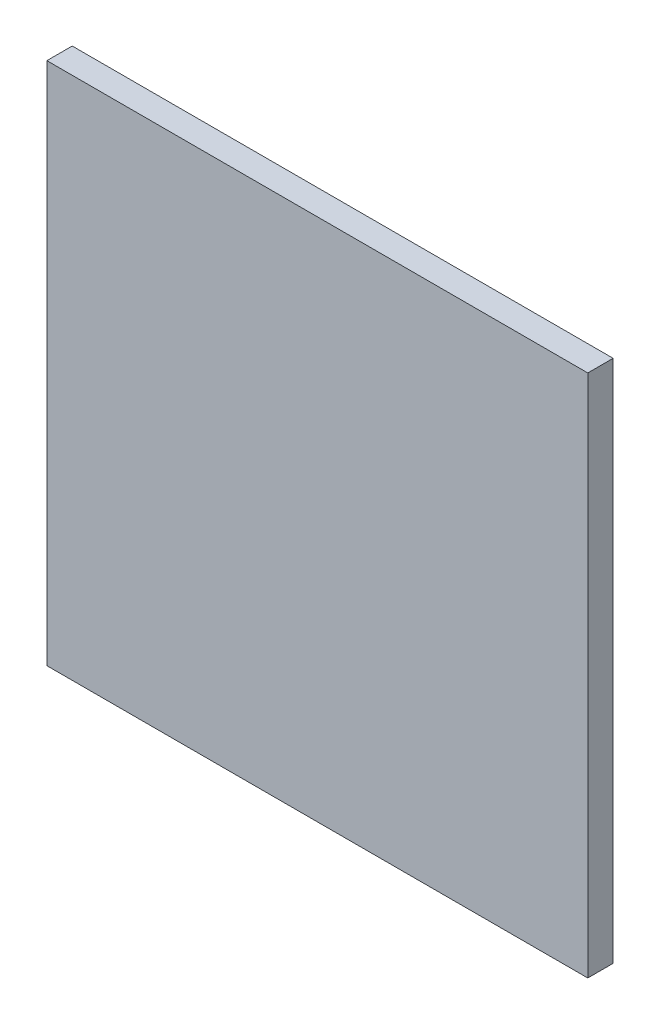
ISO-10303-21;
HEADER;
FILE_DESCRIPTION(('STEP AP214'),'2;1');
FILE_NAME('part.step','',(''),(''),'','','');
FILE_SCHEMA(('AUTOMOTIVE_DESIGN { 1 0 10303 214 1 1 1 1 }'));
ENDSEC;
DATA;
#1=APPLICATION_CONTEXT('core data for automotive mechanical design processes');
#2=APPLICATION_PROTOCOL_DEFINITION('international standard','automotive_design',2000,#1);
#3=PRODUCT_CONTEXT('',#1,'mechanical');
#4=PRODUCT('Part','Part','',(#3));
#5=PRODUCT_RELATED_PRODUCT_CATEGORY('part','',(#4));
#6=PRODUCT_DEFINITION_FORMATION('','',#4);
#7=PRODUCT_DEFINITION_CONTEXT('part definition',#1,'design');
#8=PRODUCT_DEFINITION('design','',#6,#7);
#9=PRODUCT_DEFINITION_SHAPE('','',#8);
#10=(LENGTH_UNIT() NAMED_UNIT(*) SI_UNIT(.MILLI.,.METRE.));
#11=(NAMED_UNIT(*) PLANE_ANGLE_UNIT() SI_UNIT($,.RADIAN.));
#12=(NAMED_UNIT(*) SI_UNIT($,.STERADIAN.) SOLID_ANGLE_UNIT());
#13=UNCERTAINTY_MEASURE_WITH_UNIT(LENGTH_MEASURE(1.E-05),#10,'distance_accuracy_value','');
#14=(GEOMETRIC_REPRESENTATION_CONTEXT(3) GLOBAL_UNCERTAINTY_ASSIGNED_CONTEXT((#13)) GLOBAL_UNIT_ASSIGNED_CONTEXT((#10,
#11,#12)) REPRESENTATION_CONTEXT('',''));
#15=CARTESIAN_POINT('',(0.,0.,0.));
#16=DIRECTION('',(0.,0.,1.));
#17=DIRECTION('',(1.,0.,0.));
#18=AXIS2_PLACEMENT_3D('',#15,#16,#17);
#19=CARTESIAN_POINT('',(-16.,15.5,0.75));
#20=DIRECTION('',(1.,0.,0.));
#21=DIRECTION('',(0.,0.,-1.));
#22=AXIS2_PLACEMENT_3D('',#19,#20,#21);
#23=PLANE('',#22);
#24=DIRECTION('',(0.,-1.,0.));
#25=VECTOR('',#24,1.);
#26=CARTESIAN_POINT('',(-16.,15.5,-0.75));
#27=LINE('',#26,#25);
#28=CARTESIAN_POINT('',(-16.,15.5,-0.75));
#29=VERTEX_POINT('',#28);
#30=CARTESIAN_POINT('',(-16.,-15.5,-0.75));
#31=VERTEX_POINT('',#30);
#32=EDGE_CURVE('E95',#29,#31,#27,.T.);
#33=ORIENTED_EDGE('',*,*,#32,.T.);
#34=DIRECTION('',(0.,0.,-1.));
#35=VECTOR('',#34,1.);
#36=CARTESIAN_POINT('',(-16.,-15.5,0.75));
#37=LINE('',#36,#35);
#38=CARTESIAN_POINT('',(-16.,-15.5,0.75));
#39=VERTEX_POINT('',#38);
#40=EDGE_CURVE('E11',#39,#31,#37,.T.);
#41=ORIENTED_EDGE('',*,*,#40,.F.);
#42=DIRECTION('',(0.,-1.,0.));
#43=VECTOR('',#42,1.);
#44=CARTESIAN_POINT('',(-16.,15.5,0.75));
#45=LINE('',#44,#43);
#46=CARTESIAN_POINT('',(-16.,15.5,0.75));
#47=VERTEX_POINT('',#46);
#48=EDGE_CURVE('E83',#47,#39,#45,.T.);
#49=ORIENTED_EDGE('',*,*,#48,.F.);
#50=DIRECTION('',(0.,0.,-1.));
#51=VECTOR('',#50,1.);
#52=CARTESIAN_POINT('',(-16.,15.5,0.75));
#53=LINE('',#52,#51);
#54=EDGE_CURVE('E91',#47,#29,#53,.T.);
#55=ORIENTED_EDGE('',*,*,#54,.T.);
#56=EDGE_LOOP('',(#33,#41,#49,#55));
#57=FACE_BOUND('',#56,.T.);
#58=ADVANCED_FACE('F32',(#57),#23,.F.);
#59=CARTESIAN_POINT('',(-16.,-15.5,0.75));
#60=DIRECTION('',(0.,1.,0.));
#61=DIRECTION('',(0.,0.,1.));
#62=AXIS2_PLACEMENT_3D('',#59,#60,#61);
#63=PLANE('',#62);
#64=DIRECTION('',(1.,0.,0.));
#65=VECTOR('',#64,1.);
#66=CARTESIAN_POINT('',(-16.,-15.5,-0.75));
#67=LINE('',#66,#65);
#68=CARTESIAN_POINT('',(16.,-15.5,-0.75));
#69=VERTEX_POINT('',#68);
#70=EDGE_CURVE('E87',#31,#69,#67,.T.);
#71=ORIENTED_EDGE('',*,*,#70,.T.);
#72=DIRECTION('',(0.,0.,-1.));
#73=VECTOR('',#72,1.);
#74=CARTESIAN_POINT('',(16.,-15.5,0.75));
#75=LINE('',#74,#73);
#76=CARTESIAN_POINT('',(16.,-15.5,0.75));
#77=VERTEX_POINT('',#76);
#78=EDGE_CURVE('E40',#77,#69,#75,.T.);
#79=ORIENTED_EDGE('',*,*,#78,.F.);
#80=DIRECTION('',(1.,0.,0.));
#81=VECTOR('',#80,1.);
#82=CARTESIAN_POINT('',(-16.,-15.5,0.75));
#83=LINE('',#82,#81);
#84=EDGE_CURVE('E78',#39,#77,#83,.T.);
#85=ORIENTED_EDGE('',*,*,#84,.F.);
#86=ORIENTED_EDGE('',*,*,#40,.T.);
#87=EDGE_LOOP('',(#71,#79,#85,#86));
#88=FACE_BOUND('',#87,.T.);
#89=ADVANCED_FACE('F86',(#88),#63,.F.);
#90=CARTESIAN_POINT('',(16.,15.5,0.75));
#91=DIRECTION('',(-1.,0.,0.));
#92=DIRECTION('',(0.,0.,1.));
#93=AXIS2_PLACEMENT_3D('',#90,#91,#92);
#94=PLANE('',#93);
#95=DIRECTION('',(0.,1.,0.));
#96=VECTOR('',#95,1.);
#97=CARTESIAN_POINT('',(16.,15.5,-0.75));
#98=LINE('',#97,#96);
#99=CARTESIAN_POINT('',(16.,15.5,-0.75));
#100=VERTEX_POINT('',#99);
#101=EDGE_CURVE('E65',#69,#100,#98,.T.);
#102=ORIENTED_EDGE('',*,*,#101,.T.);
#103=DIRECTION('',(0.,0.,-1.));
#104=VECTOR('',#103,1.);
#105=CARTESIAN_POINT('',(16.,15.5,0.75));
#106=LINE('',#105,#104);
#107=CARTESIAN_POINT('',(16.,15.5,0.75));
#108=VERTEX_POINT('',#107);
#109=EDGE_CURVE('E88',#108,#100,#106,.T.);
#110=ORIENTED_EDGE('',*,*,#109,.F.);
#111=DIRECTION('',(0.,1.,0.));
#112=VECTOR('',#111,1.);
#113=CARTESIAN_POINT('',(16.,15.5,0.75));
#114=LINE('',#113,#112);
#115=EDGE_CURVE('E81',#77,#108,#114,.T.);
#116=ORIENTED_EDGE('',*,*,#115,.F.);
#117=ORIENTED_EDGE('',*,*,#78,.T.);
#118=EDGE_LOOP('',(#102,#110,#116,#117));
#119=FACE_BOUND('',#118,.T.);
#120=ADVANCED_FACE('F89',(#119),#94,.F.);
#121=CARTESIAN_POINT('',(-16.,15.5,0.75));
#122=DIRECTION('',(0.,-1.,0.));
#123=DIRECTION('',(0.,0.,-1.));
#124=AXIS2_PLACEMENT_3D('',#121,#122,#123);
#125=PLANE('',#124);
#126=DIRECTION('',(-1.,0.,0.));
#127=VECTOR('',#126,1.);
#128=CARTESIAN_POINT('',(-16.,15.5,-0.75));
#129=LINE('',#128,#127);
#130=EDGE_CURVE('E71',#100,#29,#129,.T.);
#131=ORIENTED_EDGE('',*,*,#130,.T.);
#132=ORIENTED_EDGE('',*,*,#54,.F.);
#133=DIRECTION('',(-1.,0.,0.));
#134=VECTOR('',#133,1.);
#135=CARTESIAN_POINT('',(-16.,15.5,0.75));
#136=LINE('',#135,#134);
#137=EDGE_CURVE('E48',#108,#47,#136,.T.);
#138=ORIENTED_EDGE('',*,*,#137,.F.);
#139=ORIENTED_EDGE('',*,*,#109,.T.);
#140=EDGE_LOOP('',(#131,#132,#138,#139));
#141=FACE_BOUND('',#140,.T.);
#142=ADVANCED_FACE('F102',(#141),#125,.F.);
#143=CARTESIAN_POINT('',(0.,0.,0.75));
#144=DIRECTION('',(0.,0.,1.));
#145=DIRECTION('',(1.,0.,0.));
#146=AXIS2_PLACEMENT_3D('',#143,#144,#145);
#147=PLANE('',#146);
#148=ORIENTED_EDGE('',*,*,#48,.T.);
#149=ORIENTED_EDGE('',*,*,#84,.T.);
#150=ORIENTED_EDGE('',*,*,#115,.T.);
#151=ORIENTED_EDGE('',*,*,#137,.T.);
#152=EDGE_LOOP('',(#148,#149,#150,#151));
#153=FACE_BOUND('',#152,.T.);
#154=ADVANCED_FACE('F79',(#153),#147,.T.);
#155=CARTESIAN_POINT('',(0.,0.,-0.75));
#156=DIRECTION('',(0.,0.,1.));
#157=DIRECTION('',(1.,0.,0.));
#158=AXIS2_PLACEMENT_3D('',#155,#156,#157);
#159=PLANE('',#158);
#160=ORIENTED_EDGE('',*,*,#32,.F.);
#161=ORIENTED_EDGE('',*,*,#130,.F.);
#162=ORIENTED_EDGE('',*,*,#101,.F.);
#163=ORIENTED_EDGE('',*,*,#70,.F.);
#164=EDGE_LOOP('',(#160,#161,#162,#163));
#165=FACE_BOUND('',#164,.T.);
#166=ADVANCED_FACE('F105',(#165),#159,.F.);
#167=CLOSED_SHELL('',(#58,#89,#120,#142,#154,#166));
#168=MANIFOLD_SOLID_BREP('B2',#167);
#169=ADVANCED_BREP_SHAPE_REPRESENTATION('',(#18,#168),#14);
#170=SHAPE_DEFINITION_REPRESENTATION(#9,#169);
ENDSEC;
END-ISO-10303-21;
